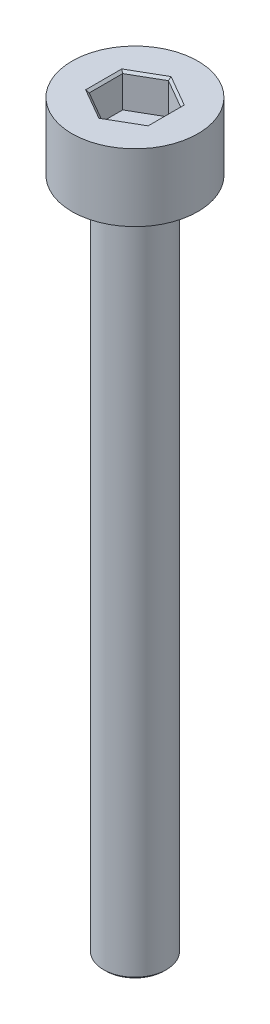
ISO-10303-21;
HEADER;
FILE_DESCRIPTION(('STEP AP214'),'2;1');
FILE_NAME('part.step','',(''),(''),'','','');
FILE_SCHEMA(('AUTOMOTIVE_DESIGN { 1 0 10303 214 1 1 1 1 }'));
ENDSEC;
DATA;
#1=APPLICATION_CONTEXT('core data for automotive mechanical design processes');
#2=APPLICATION_PROTOCOL_DEFINITION('international standard','automotive_design',2000,#1);
#3=PRODUCT_CONTEXT('',#1,'mechanical');
#4=PRODUCT('Part','Part','',(#3));
#5=PRODUCT_RELATED_PRODUCT_CATEGORY('part','',(#4));
#6=PRODUCT_DEFINITION_FORMATION('','',#4);
#7=PRODUCT_DEFINITION_CONTEXT('part definition',#1,'design');
#8=PRODUCT_DEFINITION('design','',#6,#7);
#9=PRODUCT_DEFINITION_SHAPE('','',#8);
#10=(LENGTH_UNIT() NAMED_UNIT(*) SI_UNIT(.MILLI.,.METRE.));
#11=(NAMED_UNIT(*) PLANE_ANGLE_UNIT() SI_UNIT($,.RADIAN.));
#12=(NAMED_UNIT(*) SI_UNIT($,.STERADIAN.) SOLID_ANGLE_UNIT());
#13=UNCERTAINTY_MEASURE_WITH_UNIT(LENGTH_MEASURE(1.E-05),#10,'distance_accuracy_value','');
#14=(GEOMETRIC_REPRESENTATION_CONTEXT(3) GLOBAL_UNCERTAINTY_ASSIGNED_CONTEXT((#13)) GLOBAL_UNIT_ASSIGNED_CONTEXT((#10,
#11,#12)) REPRESENTATION_CONTEXT('',''));
#15=CARTESIAN_POINT('',(0.,0.,0.));
#16=DIRECTION('',(0.,0.,1.));
#17=DIRECTION('',(1.,0.,0.));
#18=AXIS2_PLACEMENT_3D('',#15,#16,#17);
#19=CARTESIAN_POINT('',(0.,3.,0.));
#20=DIRECTION('',(0.,-1.,0.));
#21=DIRECTION('',(0.,0.,-1.));
#22=AXIS2_PLACEMENT_3D('',#19,#20,#21);
#23=CYLINDRICAL_SURFACE('',#22,2.8);
#24=CARTESIAN_POINT('',(0.,3.,0.));
#25=DIRECTION('',(0.,1.,0.));
#26=DIRECTION('',(0.,0.,1.));
#27=AXIS2_PLACEMENT_3D('',#24,#25,#26);
#28=CIRCLE('',#27,2.8);
#29=CARTESIAN_POINT('',(0.,3.,2.8));
#30=VERTEX_POINT('',#29);
#31=EDGE_CURVE('E175',#30,#30,#28,.T.);
#32=ORIENTED_EDGE('',*,*,#31,.F.);
#33=EDGE_LOOP('',(#32));
#34=FACE_BOUND('',#33,.T.);
#35=CARTESIAN_POINT('',(0.,0.,0.));
#36=DIRECTION('',(0.,1.,0.));
#37=DIRECTION('',(0.,0.,1.));
#38=AXIS2_PLACEMENT_3D('',#35,#36,#37);
#39=CIRCLE('',#38,2.8);
#40=CARTESIAN_POINT('',(0.,0.,2.8));
#41=VERTEX_POINT('',#40);
#42=EDGE_CURVE('E160',#41,#41,#39,.T.);
#43=ORIENTED_EDGE('',*,*,#42,.T.);
#44=EDGE_LOOP('',(#43));
#45=FACE_BOUND('',#44,.T.);
#46=ADVANCED_FACE('F41',(#34,#45),#23,.T.);
#47=CARTESIAN_POINT('',(0.,3.,0.));
#48=DIRECTION('',(0.,1.,0.));
#49=DIRECTION('',(0.,0.,1.));
#50=AXIS2_PLACEMENT_3D('',#47,#48,#49);
#51=PLANE('',#50);
#52=DIRECTION('',(0.866025403784439,0.,-0.5));
#53=VECTOR('',#52,1.);
#54=CARTESIAN_POINT('',(-0.0499999999999996,3.,-1.57616623488768));
#55=LINE('',#54,#53);
#56=CARTESIAN_POINT('',(-1.39,3.,-0.80251687417358));
#57=VERTEX_POINT('',#56);
#58=CARTESIAN_POINT('',(0.,3.,-1.60503374834716));
#59=VERTEX_POINT('',#58);
#60=EDGE_CURVE('E198',#57,#59,#55,.T.);
#61=ORIENTED_EDGE('',*,*,#60,.T.);
#62=DIRECTION('',(0.866025403784439,0.,0.5));
#63=VECTOR('',#62,1.);
#64=CARTESIAN_POINT('',(1.34,3.,-0.831384387633062));
#65=LINE('',#64,#63);
#66=CARTESIAN_POINT('',(1.39,3.,-0.802516874173581));
#67=VERTEX_POINT('',#66);
#68=EDGE_CURVE('E201',#59,#67,#65,.T.);
#69=ORIENTED_EDGE('',*,*,#68,.T.);
#70=DIRECTION('',(0.,0.,1.));
#71=VECTOR('',#70,1.);
#72=CARTESIAN_POINT('',(1.39,3.,0.744781847254617));
#73=LINE('',#72,#71);
#74=CARTESIAN_POINT('',(1.39,3.,0.802516874173579));
#75=VERTEX_POINT('',#74);
#76=EDGE_CURVE('E186',#67,#75,#73,.T.);
#77=ORIENTED_EDGE('',*,*,#76,.T.);
#78=DIRECTION('',(-0.866025403784438,0.,0.5));
#79=VECTOR('',#78,1.);
#80=CARTESIAN_POINT('',(0.0499999999999993,3.,1.57616623488768));
#81=LINE('',#80,#79);
#82=CARTESIAN_POINT('',(0.,3.,1.60503374834716));
#83=VERTEX_POINT('',#82);
#84=EDGE_CURVE('E189',#75,#83,#81,.T.);
#85=ORIENTED_EDGE('',*,*,#84,.T.);
#86=DIRECTION('',(-0.866025403784439,0.,-0.5));
#87=VECTOR('',#86,1.);
#88=CARTESIAN_POINT('',(-1.34,3.,0.831384387633061));
#89=LINE('',#88,#87);
#90=CARTESIAN_POINT('',(-1.39,3.,0.80251687417358));
#91=VERTEX_POINT('',#90);
#92=EDGE_CURVE('E192',#83,#91,#89,.T.);
#93=ORIENTED_EDGE('',*,*,#92,.T.);
#94=DIRECTION('',(0.,0.,-1.));
#95=VECTOR('',#94,1.);
#96=CARTESIAN_POINT('',(-1.39,3.,-0.744781847254617));
#97=LINE('',#96,#95);
#98=EDGE_CURVE('E195',#91,#57,#97,.T.);
#99=ORIENTED_EDGE('',*,*,#98,.T.);
#100=EDGE_LOOP('',(#61,#69,#77,#85,#93,#99));
#101=FACE_BOUND('',#100,.T.);
#102=ORIENTED_EDGE('',*,*,#31,.T.);
#103=EDGE_LOOP('',(#102));
#104=FACE_BOUND('',#103,.T.);
#105=ADVANCED_FACE('F272',(#101,#104),#51,.T.);
#106=CARTESIAN_POINT('',(0.,0.,0.));
#107=DIRECTION('',(0.,1.,0.));
#108=DIRECTION('',(0.,0.,1.));
#109=AXIS2_PLACEMENT_3D('',#106,#107,#108);
#110=PLANE('',#109);
#111=CARTESIAN_POINT('',(0.,0.,0.));
#112=DIRECTION('',(0.,-1.,0.));
#113=DIRECTION('',(0.,0.,-1.));
#114=AXIS2_PLACEMENT_3D('',#111,#112,#113);
#115=CIRCLE('',#114,1.4);
#116=CARTESIAN_POINT('',(0.,0.,-1.4));
#117=VERTEX_POINT('',#116);
#118=EDGE_CURVE('E144',#117,#117,#115,.T.);
#119=ORIENTED_EDGE('',*,*,#118,.F.);
#120=EDGE_LOOP('',(#119));
#121=FACE_BOUND('',#120,.T.);
#122=ORIENTED_EDGE('',*,*,#42,.F.);
#123=EDGE_LOOP('',(#122));
#124=FACE_BOUND('',#123,.T.);
#125=ADVANCED_FACE('F291',(#121,#124),#110,.F.);
#126=CARTESIAN_POINT('',(-1.29,1.5,0.744781847254617));
#127=DIRECTION('',(-0.5,0.,0.866025403784438));
#128=DIRECTION('',(0.866025403784439,0.,0.5));
#129=AXIS2_PLACEMENT_3D('',#126,#127,#128);
#130=PLANE('',#129);
#131=DIRECTION('',(0.,1.,0.));
#132=VECTOR('',#131,1.);
#133=CARTESIAN_POINT('',(-1.29,1.5,0.744781847254617));
#134=LINE('',#133,#132);
#135=CARTESIAN_POINT('',(-1.29,1.5,0.744781847254617));
#136=VERTEX_POINT('',#135);
#137=CARTESIAN_POINT('',(-1.29,2.9,0.744781847254617));
#138=VERTEX_POINT('',#137);
#139=EDGE_CURVE('E157',#136,#138,#134,.T.);
#140=ORIENTED_EDGE('',*,*,#139,.T.);
#141=DIRECTION('',(0.866025403784439,0.,0.5));
#142=VECTOR('',#141,1.);
#143=CARTESIAN_POINT('',(0.,2.9,1.48956369450923));
#144=LINE('',#143,#142);
#145=CARTESIAN_POINT('',(0.,2.9,1.48956369450923));
#146=VERTEX_POINT('',#145);
#147=EDGE_CURVE('E68',#138,#146,#144,.T.);
#148=ORIENTED_EDGE('',*,*,#147,.T.);
#149=DIRECTION('',(0.,1.,0.));
#150=VECTOR('',#149,1.);
#151=CARTESIAN_POINT('',(0.,1.5,1.48956369450923));
#152=LINE('',#151,#150);
#153=CARTESIAN_POINT('',(0.,1.5,1.48956369450923));
#154=VERTEX_POINT('',#153);
#155=EDGE_CURVE('E115',#154,#146,#152,.T.);
#156=ORIENTED_EDGE('',*,*,#155,.F.);
#157=DIRECTION('',(0.866025403784439,0.,0.5));
#158=VECTOR('',#157,1.);
#159=CARTESIAN_POINT('',(-1.29,1.5,0.744781847254617));
#160=LINE('',#159,#158);
#161=EDGE_CURVE('E119',#136,#154,#160,.T.);
#162=ORIENTED_EDGE('',*,*,#161,.F.);
#163=EDGE_LOOP('',(#140,#148,#156,#162));
#164=FACE_BOUND('',#163,.T.);
#165=ADVANCED_FACE('F117',(#164),#130,.F.);
#166=CARTESIAN_POINT('',(-1.29,1.5,-0.744781847254617));
#167=DIRECTION('',(-1.,0.,0.));
#168=DIRECTION('',(0.,0.,1.));
#169=AXIS2_PLACEMENT_3D('',#166,#167,#168);
#170=PLANE('',#169);
#171=DIRECTION('',(0.,1.,0.));
#172=VECTOR('',#171,1.);
#173=CARTESIAN_POINT('',(-1.29,1.5,-0.744781847254617));
#174=LINE('',#173,#172);
#175=CARTESIAN_POINT('',(-1.29,1.5,-0.744781847254617));
#176=VERTEX_POINT('',#175);
#177=CARTESIAN_POINT('',(-1.29,2.9,-0.744781847254617));
#178=VERTEX_POINT('',#177);
#179=EDGE_CURVE('E161',#176,#178,#174,.T.);
#180=ORIENTED_EDGE('',*,*,#179,.T.);
#181=DIRECTION('',(0.,0.,1.));
#182=VECTOR('',#181,1.);
#183=CARTESIAN_POINT('',(-1.29,2.9,0.744781847254617));
#184=LINE('',#183,#182);
#185=EDGE_CURVE('E208',#178,#138,#184,.T.);
#186=ORIENTED_EDGE('',*,*,#185,.T.);
#187=ORIENTED_EDGE('',*,*,#139,.F.);
#188=DIRECTION('',(0.,0.,1.));
#189=VECTOR('',#188,1.);
#190=CARTESIAN_POINT('',(-1.29,1.5,-0.744781847254617));
#191=LINE('',#190,#189);
#192=EDGE_CURVE('E124',#176,#136,#191,.T.);
#193=ORIENTED_EDGE('',*,*,#192,.F.);
#194=EDGE_LOOP('',(#180,#186,#187,#193));
#195=FACE_BOUND('',#194,.T.);
#196=ADVANCED_FACE('F263',(#195),#170,.F.);
#197=CARTESIAN_POINT('',(0.,1.5,-1.48956369450924));
#198=DIRECTION('',(-0.5,0.,-0.866025403784438));
#199=DIRECTION('',(-0.866025403784439,0.,0.5));
#200=AXIS2_PLACEMENT_3D('',#197,#198,#199);
#201=PLANE('',#200);
#202=DIRECTION('',(0.,1.,0.));
#203=VECTOR('',#202,1.);
#204=CARTESIAN_POINT('',(0.,1.5,-1.48956369450924));
#205=LINE('',#204,#203);
#206=CARTESIAN_POINT('',(0.,1.5,-1.48956369450924));
#207=VERTEX_POINT('',#206);
#208=CARTESIAN_POINT('',(0.,2.9,-1.48956369450924));
#209=VERTEX_POINT('',#208);
#210=EDGE_CURVE('E165',#207,#209,#205,.T.);
#211=ORIENTED_EDGE('',*,*,#210,.T.);
#212=DIRECTION('',(-0.866025403784439,0.,0.5));
#213=VECTOR('',#212,1.);
#214=CARTESIAN_POINT('',(-1.29,2.9,-0.744781847254617));
#215=LINE('',#214,#213);
#216=EDGE_CURVE('E205',#209,#178,#215,.T.);
#217=ORIENTED_EDGE('',*,*,#216,.T.);
#218=ORIENTED_EDGE('',*,*,#179,.F.);
#219=DIRECTION('',(-0.866025403784439,0.,0.5));
#220=VECTOR('',#219,1.);
#221=CARTESIAN_POINT('',(0.,1.5,-1.48956369450924));
#222=LINE('',#221,#220);
#223=EDGE_CURVE('E152',#207,#176,#222,.T.);
#224=ORIENTED_EDGE('',*,*,#223,.F.);
#225=EDGE_LOOP('',(#211,#217,#218,#224));
#226=FACE_BOUND('',#225,.T.);
#227=ADVANCED_FACE('F264',(#226),#201,.F.);
#228=CARTESIAN_POINT('',(1.29,1.5,-0.744781847254619));
#229=DIRECTION('',(0.5,0.,-0.866025403784438));
#230=DIRECTION('',(-0.866025403784439,0.,-0.5));
#231=AXIS2_PLACEMENT_3D('',#228,#229,#230);
#232=PLANE('',#231);
#233=DIRECTION('',(0.,1.,0.));
#234=VECTOR('',#233,1.);
#235=CARTESIAN_POINT('',(1.29,1.5,-0.744781847254619));
#236=LINE('',#235,#234);
#237=CARTESIAN_POINT('',(1.29,1.5,-0.744781847254619));
#238=VERTEX_POINT('',#237);
#239=CARTESIAN_POINT('',(1.29,2.9,-0.744781847254619));
#240=VERTEX_POINT('',#239);
#241=EDGE_CURVE('E169',#238,#240,#236,.T.);
#242=ORIENTED_EDGE('',*,*,#241,.T.);
#243=DIRECTION('',(-0.866025403784439,0.,-0.5));
#244=VECTOR('',#243,1.);
#245=CARTESIAN_POINT('',(0.,2.9,-1.48956369450924));
#246=LINE('',#245,#244);
#247=EDGE_CURVE('E182',#240,#209,#246,.T.);
#248=ORIENTED_EDGE('',*,*,#247,.T.);
#249=ORIENTED_EDGE('',*,*,#210,.F.);
#250=DIRECTION('',(-0.866025403784439,0.,-0.5));
#251=VECTOR('',#250,1.);
#252=CARTESIAN_POINT('',(1.29,1.5,-0.744781847254619));
#253=LINE('',#252,#251);
#254=EDGE_CURVE('E148',#238,#207,#253,.T.);
#255=ORIENTED_EDGE('',*,*,#254,.F.);
#256=EDGE_LOOP('',(#242,#248,#249,#255));
#257=FACE_BOUND('',#256,.T.);
#258=ADVANCED_FACE('F259',(#257),#232,.F.);
#259=CARTESIAN_POINT('',(1.29,1.5,0.744781847254617));
#260=DIRECTION('',(1.,0.,0.));
#261=DIRECTION('',(0.,0.,-1.));
#262=AXIS2_PLACEMENT_3D('',#259,#260,#261);
#263=PLANE('',#262);
#264=DIRECTION('',(0.,1.,0.));
#265=VECTOR('',#264,1.);
#266=CARTESIAN_POINT('',(1.29,1.5,0.744781847254617));
#267=LINE('',#266,#265);
#268=CARTESIAN_POINT('',(1.29,1.5,0.744781847254617));
#269=VERTEX_POINT('',#268);
#270=CARTESIAN_POINT('',(1.29,2.9,0.744781847254617));
#271=VERTEX_POINT('',#270);
#272=EDGE_CURVE('E123',#269,#271,#267,.T.);
#273=ORIENTED_EDGE('',*,*,#272,.T.);
#274=DIRECTION('',(0.,0.,-1.));
#275=VECTOR('',#274,1.);
#276=CARTESIAN_POINT('',(1.29,2.9,-0.744781847254619));
#277=LINE('',#276,#275);
#278=EDGE_CURVE('E215',#271,#240,#277,.T.);
#279=ORIENTED_EDGE('',*,*,#278,.T.);
#280=ORIENTED_EDGE('',*,*,#241,.F.);
#281=DIRECTION('',(0.,0.,-1.));
#282=VECTOR('',#281,1.);
#283=CARTESIAN_POINT('',(1.29,1.5,0.744781847254617));
#284=LINE('',#283,#282);
#285=EDGE_CURVE('E133',#269,#238,#284,.T.);
#286=ORIENTED_EDGE('',*,*,#285,.F.);
#287=EDGE_LOOP('',(#273,#279,#280,#286));
#288=FACE_BOUND('',#287,.T.);
#289=ADVANCED_FACE('F256',(#288),#263,.F.);
#290=CARTESIAN_POINT('',(0.,1.5,1.48956369450923));
#291=DIRECTION('',(0.5,0.,0.866025403784438));
#292=DIRECTION('',(0.866025403784438,0.,-0.5));
#293=AXIS2_PLACEMENT_3D('',#290,#291,#292);
#294=PLANE('',#293);
#295=ORIENTED_EDGE('',*,*,#155,.T.);
#296=DIRECTION('',(0.866025403784438,0.,-0.5));
#297=VECTOR('',#296,1.);
#298=CARTESIAN_POINT('',(1.29,2.9,0.744781847254617));
#299=LINE('',#298,#297);
#300=EDGE_CURVE('E60',#146,#271,#299,.T.);
#301=ORIENTED_EDGE('',*,*,#300,.T.);
#302=ORIENTED_EDGE('',*,*,#272,.F.);
#303=DIRECTION('',(0.866025403784438,0.,-0.5));
#304=VECTOR('',#303,1.);
#305=CARTESIAN_POINT('',(0.,1.5,1.48956369450923));
#306=LINE('',#305,#304);
#307=EDGE_CURVE('E127',#154,#269,#306,.T.);
#308=ORIENTED_EDGE('',*,*,#307,.F.);
#309=EDGE_LOOP('',(#295,#301,#302,#308));
#310=FACE_BOUND('',#309,.T.);
#311=ADVANCED_FACE('F128',(#310),#294,.F.);
#312=CARTESIAN_POINT('',(0.,1.5,0.));
#313=DIRECTION('',(0.,1.,0.));
#314=DIRECTION('',(0.,0.,1.));
#315=AXIS2_PLACEMENT_3D('',#312,#313,#314);
#316=PLANE('',#315);
#317=ORIENTED_EDGE('',*,*,#161,.T.);
#318=ORIENTED_EDGE('',*,*,#307,.T.);
#319=ORIENTED_EDGE('',*,*,#285,.T.);
#320=ORIENTED_EDGE('',*,*,#254,.T.);
#321=ORIENTED_EDGE('',*,*,#223,.T.);
#322=ORIENTED_EDGE('',*,*,#192,.T.);
#323=EDGE_LOOP('',(#317,#318,#319,#320,#321,#322));
#324=FACE_BOUND('',#323,.T.);
#325=ADVANCED_FACE('F135',(#324),#316,.T.);
#326=CARTESIAN_POINT('',(0.,-30.,0.));
#327=DIRECTION('',(0.,1.,0.));
#328=DIRECTION('',(0.,0.,1.));
#329=AXIS2_PLACEMENT_3D('',#326,#327,#328);
#330=CYLINDRICAL_SURFACE('',#329,1.4);
#331=CARTESIAN_POINT('',(0.,-29.9,0.));
#332=DIRECTION('',(0.,-1.,0.));
#333=DIRECTION('',(0.,0.,-1.));
#334=AXIS2_PLACEMENT_3D('',#331,#332,#333);
#335=CIRCLE('',#334,1.4);
#336=CARTESIAN_POINT('',(0.,-29.9,-1.4));
#337=VERTEX_POINT('',#336);
#338=EDGE_CURVE('E11',#337,#337,#335,.F.);
#339=ORIENTED_EDGE('',*,*,#338,.T.);
#340=EDGE_LOOP('',(#339));
#341=FACE_BOUND('',#340,.T.);
#342=ORIENTED_EDGE('',*,*,#118,.T.);
#343=EDGE_LOOP('',(#342));
#344=FACE_BOUND('',#343,.T.);
#345=ADVANCED_FACE('F313',(#341,#344),#330,.T.);
#346=CARTESIAN_POINT('',(0.,-30.,0.));
#347=DIRECTION('',(0.,-1.,0.));
#348=DIRECTION('',(0.,0.,-1.));
#349=AXIS2_PLACEMENT_3D('',#346,#347,#348);
#350=PLANE('',#349);
#351=CARTESIAN_POINT('',(0.,-30.,0.));
#352=DIRECTION('',(0.,-1.,0.));
#353=DIRECTION('',(0.,0.,-1.));
#354=AXIS2_PLACEMENT_3D('',#351,#352,#353);
#355=CIRCLE('',#354,1.30000000000001);
#356=CARTESIAN_POINT('',(0.,-30.,-1.30000000000001));
#357=VERTEX_POINT('',#356);
#358=EDGE_CURVE('E52',#357,#357,#355,.T.);
#359=ORIENTED_EDGE('',*,*,#358,.T.);
#360=EDGE_LOOP('',(#359));
#361=FACE_BOUND('',#360,.T.);
#362=ADVANCED_FACE('F316',(#361),#350,.T.);
#363=CARTESIAN_POINT('',(-1.29,2.9,0.744781847254617));
#364=DIRECTION('',(0.353553390593268,0.70710678118656,-0.612372435695784));
#365=DIRECTION('',(-0.866025403784439,0.,-0.5));
#366=AXIS2_PLACEMENT_3D('',#363,#364,#365);
#367=PLANE('',#366);
#368=DIRECTION('',(-0.654653670707987,0.654653670707964,0.377964473009233));
#369=VECTOR('',#368,1.);
#370=CARTESIAN_POINT('',(-0.921428571428561,2.53142857142858,0.531987033753292));
#371=LINE('',#370,#369);
#372=EDGE_CURVE('E142',#91,#138,#371,.F.);
#373=ORIENTED_EDGE('',*,*,#372,.F.);
#374=ORIENTED_EDGE('',*,*,#92,.F.);
#375=DIRECTION('',(0.,0.654653670707965,0.755928946018465));
#376=VECTOR('',#375,1.);
#377=CARTESIAN_POINT('',(0.,2.53142857142858,1.06397406750659));
#378=LINE('',#377,#376);
#379=EDGE_CURVE('E46',#146,#83,#378,.T.);
#380=ORIENTED_EDGE('',*,*,#379,.F.);
#381=ORIENTED_EDGE('',*,*,#147,.F.);
#382=EDGE_LOOP('',(#373,#374,#380,#381));
#383=FACE_BOUND('',#382,.T.);
#384=ADVANCED_FACE('F244',(#383),#367,.T.);
#385=CARTESIAN_POINT('',(0.,2.9,1.48956369450923));
#386=DIRECTION('',(-0.353553390593269,0.707106781186558,-0.612372435695785));
#387=DIRECTION('',(-0.866025403784438,0.,0.5));
#388=AXIS2_PLACEMENT_3D('',#385,#386,#387);
#389=PLANE('',#388);
#390=ORIENTED_EDGE('',*,*,#379,.T.);
#391=ORIENTED_EDGE('',*,*,#84,.F.);
#392=DIRECTION('',(0.654653670707988,0.654653670707965,0.377964473009229));
#393=VECTOR('',#392,1.);
#394=CARTESIAN_POINT('',(0.921428571428557,2.53142857142857,0.531987033753292));
#395=LINE('',#394,#393);
#396=EDGE_CURVE('E231',#271,#75,#395,.T.);
#397=ORIENTED_EDGE('',*,*,#396,.F.);
#398=ORIENTED_EDGE('',*,*,#300,.F.);
#399=EDGE_LOOP('',(#390,#391,#397,#398));
#400=FACE_BOUND('',#399,.T.);
#401=ADVANCED_FACE('F248',(#400),#389,.T.);
#402=CARTESIAN_POINT('',(-1.29,2.9,-0.744781847254617));
#403=DIRECTION('',(0.707106781186535,0.70710678118656,0.));
#404=DIRECTION('',(0.,0.,-1.));
#405=AXIS2_PLACEMENT_3D('',#402,#403,#404);
#406=PLANE('',#405);
#407=ORIENTED_EDGE('',*,*,#372,.T.);
#408=ORIENTED_EDGE('',*,*,#185,.F.);
#409=DIRECTION('',(-0.654653670707987,0.654653670707964,-0.377964473009234));
#410=VECTOR('',#409,1.);
#411=CARTESIAN_POINT('',(-0.921428571428562,2.53142857142858,-0.531987033753292));
#412=LINE('',#411,#410);
#413=EDGE_CURVE('E227',#57,#178,#412,.F.);
#414=ORIENTED_EDGE('',*,*,#413,.F.);
#415=ORIENTED_EDGE('',*,*,#98,.F.);
#416=EDGE_LOOP('',(#407,#408,#414,#415));
#417=FACE_BOUND('',#416,.T.);
#418=ADVANCED_FACE('F240',(#417),#406,.T.);
#419=CARTESIAN_POINT('',(1.29,2.9,0.744781847254617));
#420=DIRECTION('',(-0.707106781186535,0.70710678118656,0.));
#421=DIRECTION('',(0.,0.,1.));
#422=AXIS2_PLACEMENT_3D('',#419,#420,#421);
#423=PLANE('',#422);
#424=ORIENTED_EDGE('',*,*,#396,.T.);
#425=ORIENTED_EDGE('',*,*,#76,.F.);
#426=DIRECTION('',(-0.654653670707987,-0.654653670707965,0.377964473009231));
#427=VECTOR('',#426,1.);
#428=CARTESIAN_POINT('',(1.29,2.9,-0.744781847254619));
#429=LINE('',#428,#427);
#430=EDGE_CURVE('E224',#240,#67,#429,.F.);
#431=ORIENTED_EDGE('',*,*,#430,.F.);
#432=ORIENTED_EDGE('',*,*,#278,.F.);
#433=EDGE_LOOP('',(#424,#425,#431,#432));
#434=FACE_BOUND('',#433,.T.);
#435=ADVANCED_FACE('F253',(#434),#423,.T.);
#436=CARTESIAN_POINT('',(0.,2.9,-1.48956369450924));
#437=DIRECTION('',(0.353553390593267,0.707106781186561,0.612372435695783));
#438=DIRECTION('',(0.866025403784439,0.,-0.5));
#439=AXIS2_PLACEMENT_3D('',#436,#437,#438);
#440=PLANE('',#439);
#441=ORIENTED_EDGE('',*,*,#413,.T.);
#442=ORIENTED_EDGE('',*,*,#216,.F.);
#443=DIRECTION('',(0.,0.654653670707964,-0.755928946018466));
#444=VECTOR('',#443,1.);
#445=CARTESIAN_POINT('',(0.,2.53142857142858,-1.06397406750658));
#446=LINE('',#445,#444);
#447=EDGE_CURVE('E221',#59,#209,#446,.F.);
#448=ORIENTED_EDGE('',*,*,#447,.F.);
#449=ORIENTED_EDGE('',*,*,#60,.F.);
#450=EDGE_LOOP('',(#441,#442,#448,#449));
#451=FACE_BOUND('',#450,.T.);
#452=ADVANCED_FACE('F268',(#451),#440,.T.);
#453=CARTESIAN_POINT('',(1.29,2.9,-0.744781847254619));
#454=DIRECTION('',(-0.353553390593268,0.707106781186559,0.612372435695785));
#455=DIRECTION('',(0.866025403784439,0.,0.5));
#456=AXIS2_PLACEMENT_3D('',#453,#454,#455);
#457=PLANE('',#456);
#458=ORIENTED_EDGE('',*,*,#430,.T.);
#459=ORIENTED_EDGE('',*,*,#68,.F.);
#460=ORIENTED_EDGE('',*,*,#447,.T.);
#461=ORIENTED_EDGE('',*,*,#247,.F.);
#462=EDGE_LOOP('',(#458,#459,#460,#461));
#463=FACE_BOUND('',#462,.T.);
#464=ADVANCED_FACE('F275',(#463),#457,.T.);
#465=CARTESIAN_POINT('',(0.,-30.,0.));
#466=DIRECTION('',(0.,1.,0.));
#467=DIRECTION('',(0.,0.,1.));
#468=AXIS2_PLACEMENT_3D('',#465,#466,#467);
#469=CONICAL_SURFACE('',#468,1.30000000000001,0.785398163397422);
#470=ORIENTED_EDGE('',*,*,#338,.F.);
#471=EDGE_LOOP('',(#470));
#472=FACE_BOUND('',#471,.T.);
#473=ORIENTED_EDGE('',*,*,#358,.F.);
#474=EDGE_LOOP('',(#473));
#475=FACE_BOUND('',#474,.T.);
#476=ADVANCED_FACE('F44',(#472,#475),#469,.T.);
#477=CLOSED_SHELL('',(#46,#105,#125,#165,#196,#227,#258,#289,#311,#325,#345,#362,#384,#401,#418,
#435,#452,#464,#476));
#478=MANIFOLD_SOLID_BREP('B2',#477);
#479=ADVANCED_BREP_SHAPE_REPRESENTATION('',(#18,#478),#14);
#480=SHAPE_DEFINITION_REPRESENTATION(#9,#479);
ENDSEC;
END-ISO-10303-21;
